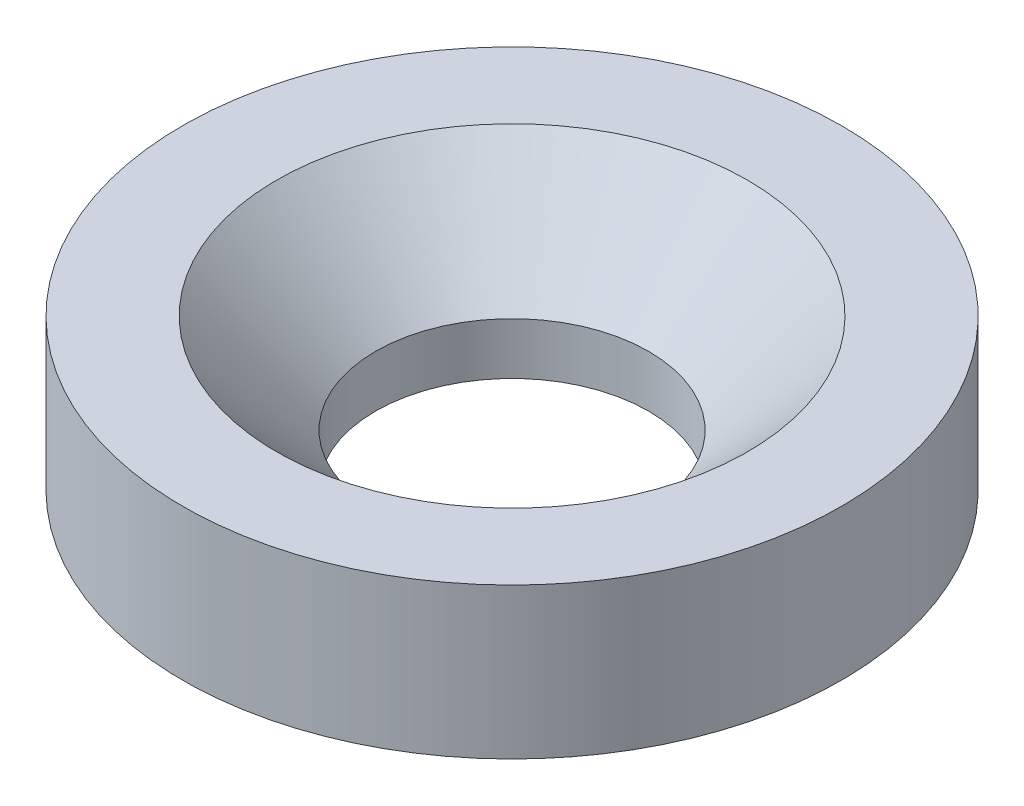
ISO-10303-21;
HEADER;
FILE_DESCRIPTION(('STEP AP214'),'2;1');
FILE_NAME('part.step','',(''),(''),'','','');
FILE_SCHEMA(('AUTOMOTIVE_DESIGN { 1 0 10303 214 1 1 1 1 }'));
ENDSEC;
DATA;
#1=APPLICATION_CONTEXT('core data for automotive mechanical design processes');
#2=APPLICATION_PROTOCOL_DEFINITION('international standard','automotive_design',2000,#1);
#3=PRODUCT_CONTEXT('',#1,'mechanical');
#4=PRODUCT('Part','Part','',(#3));
#5=PRODUCT_RELATED_PRODUCT_CATEGORY('part','',(#4));
#6=PRODUCT_DEFINITION_FORMATION('','',#4);
#7=PRODUCT_DEFINITION_CONTEXT('part definition',#1,'design');
#8=PRODUCT_DEFINITION('design','',#6,#7);
#9=PRODUCT_DEFINITION_SHAPE('','',#8);
#10=(LENGTH_UNIT() NAMED_UNIT(*) SI_UNIT(.MILLI.,.METRE.));
#11=(NAMED_UNIT(*) PLANE_ANGLE_UNIT() SI_UNIT($,.RADIAN.));
#12=(NAMED_UNIT(*) SI_UNIT($,.STERADIAN.) SOLID_ANGLE_UNIT());
#13=UNCERTAINTY_MEASURE_WITH_UNIT(LENGTH_MEASURE(1.E-05),#10,'distance_accuracy_value','');
#14=(GEOMETRIC_REPRESENTATION_CONTEXT(3) GLOBAL_UNCERTAINTY_ASSIGNED_CONTEXT((#13)) GLOBAL_UNIT_ASSIGNED_CONTEXT((#10,
#11,#12)) REPRESENTATION_CONTEXT('',''));
#15=CARTESIAN_POINT('',(0.,0.,0.));
#16=DIRECTION('',(0.,0.,1.));
#17=DIRECTION('',(1.,0.,0.));
#18=AXIS2_PLACEMENT_3D('',#15,#16,#17);
#19=CARTESIAN_POINT('',(0.,0.,0.));
#20=DIRECTION('',(0.,-1.,0.));
#21=DIRECTION('',(0.,0.,-1.));
#22=AXIS2_PLACEMENT_3D('',#19,#20,#21);
#23=CYLINDRICAL_SURFACE('',#22,7.25);
#24=CARTESIAN_POINT('',(0.,0.,0.));
#25=DIRECTION('',(0.,-1.,0.));
#26=DIRECTION('',(0.,0.,-1.));
#27=AXIS2_PLACEMENT_3D('',#24,#25,#26);
#28=CIRCLE('',#27,7.25);
#29=CARTESIAN_POINT('',(0.,0.,-7.25));
#30=VERTEX_POINT('',#29);
#31=EDGE_CURVE('E10',#30,#30,#28,.T.);
#32=ORIENTED_EDGE('',*,*,#31,.T.);
#33=EDGE_LOOP('',(#32));
#34=FACE_BOUND('',#33,.T.);
#35=CARTESIAN_POINT('',(0.,2.74999999999997,0.));
#36=DIRECTION('',(0.,-1.,0.));
#37=DIRECTION('',(0.,0.,-1.));
#38=AXIS2_PLACEMENT_3D('',#35,#36,#37);
#39=CIRCLE('',#38,7.25);
#40=CARTESIAN_POINT('',(0.,2.74999999999997,-7.25));
#41=VERTEX_POINT('',#40);
#42=EDGE_CURVE('E60',#41,#41,#39,.T.);
#43=ORIENTED_EDGE('',*,*,#42,.F.);
#44=EDGE_LOOP('',(#43));
#45=FACE_BOUND('',#44,.T.);
#46=ADVANCED_FACE('F37',(#34,#45),#23,.F.);
#47=CARTESIAN_POINT('',(7.25,0.,0.));
#48=DIRECTION('',(0.,-1.,0.));
#49=DIRECTION('',(0.,0.,-1.));
#50=AXIS2_PLACEMENT_3D('',#47,#48,#49);
#51=PLANE('',#50);
#52=CARTESIAN_POINT('',(0.,0.,0.));
#53=DIRECTION('',(0.,-1.,0.));
#54=DIRECTION('',(0.,0.,-1.));
#55=AXIS2_PLACEMENT_3D('',#52,#53,#54);
#56=CIRCLE('',#55,17.5);
#57=CARTESIAN_POINT('',(0.,0.,-17.5));
#58=VERTEX_POINT('',#57);
#59=EDGE_CURVE('E44',#58,#58,#56,.T.);
#60=ORIENTED_EDGE('',*,*,#59,.T.);
#61=EDGE_LOOP('',(#60));
#62=FACE_BOUND('',#61,.T.);
#63=ORIENTED_EDGE('',*,*,#31,.F.);
#64=EDGE_LOOP('',(#63));
#65=FACE_BOUND('',#64,.T.);
#66=ADVANCED_FACE('F69',(#62,#65),#51,.T.);
#67=CARTESIAN_POINT('',(0.,0.,0.));
#68=DIRECTION('',(0.,-1.,0.));
#69=DIRECTION('',(0.,0.,-1.));
#70=AXIS2_PLACEMENT_3D('',#67,#68,#69);
#71=CYLINDRICAL_SURFACE('',#70,17.5);
#72=CARTESIAN_POINT('',(0.,8.,0.));
#73=DIRECTION('',(0.,-1.,0.));
#74=DIRECTION('',(0.,0.,-1.));
#75=AXIS2_PLACEMENT_3D('',#72,#73,#74);
#76=CIRCLE('',#75,17.5);
#77=CARTESIAN_POINT('',(0.,8.,-17.5));
#78=VERTEX_POINT('',#77);
#79=EDGE_CURVE('E49',#78,#78,#76,.T.);
#80=ORIENTED_EDGE('',*,*,#79,.T.);
#81=EDGE_LOOP('',(#80));
#82=FACE_BOUND('',#81,.T.);
#83=ORIENTED_EDGE('',*,*,#59,.F.);
#84=EDGE_LOOP('',(#83));
#85=FACE_BOUND('',#84,.T.);
#86=ADVANCED_FACE('F73',(#82,#85),#71,.T.);
#87=CARTESIAN_POINT('',(17.5,8.,0.));
#88=DIRECTION('',(0.,1.,0.));
#89=DIRECTION('',(0.,0.,1.));
#90=AXIS2_PLACEMENT_3D('',#87,#88,#89);
#91=PLANE('',#90);
#92=CARTESIAN_POINT('',(0.,8.,0.));
#93=DIRECTION('',(0.,-1.,0.));
#94=DIRECTION('',(0.,0.,-1.));
#95=AXIS2_PLACEMENT_3D('',#92,#93,#94);
#96=CIRCLE('',#95,12.5);
#97=CARTESIAN_POINT('',(0.,8.,-12.5));
#98=VERTEX_POINT('',#97);
#99=EDGE_CURVE('E54',#98,#98,#96,.T.);
#100=ORIENTED_EDGE('',*,*,#99,.T.);
#101=EDGE_LOOP('',(#100));
#102=FACE_BOUND('',#101,.T.);
#103=ORIENTED_EDGE('',*,*,#79,.F.);
#104=EDGE_LOOP('',(#103));
#105=FACE_BOUND('',#104,.T.);
#106=ADVANCED_FACE('F77',(#102,#105),#91,.T.);
#107=CARTESIAN_POINT('',(0.,8.,0.));
#108=DIRECTION('',(0.,1.,0.));
#109=DIRECTION('',(0.,0.,1.));
#110=AXIS2_PLACEMENT_3D('',#107,#108,#109);
#111=CONICAL_SURFACE('',#110,12.5,0.785398163397445);
#112=ORIENTED_EDGE('',*,*,#42,.T.);
#113=EDGE_LOOP('',(#112));
#114=FACE_BOUND('',#113,.T.);
#115=ORIENTED_EDGE('',*,*,#99,.F.);
#116=EDGE_LOOP('',(#115));
#117=FACE_BOUND('',#116,.T.);
#118=ADVANCED_FACE('F65',(#114,#117),#111,.F.);
#119=CLOSED_SHELL('',(#46,#66,#86,#106,#118));
#120=MANIFOLD_SOLID_BREP('B2',#119);
#121=ADVANCED_BREP_SHAPE_REPRESENTATION('',(#18,#120),#14);
#122=SHAPE_DEFINITION_REPRESENTATION(#9,#121);
ENDSEC;
END-ISO-10303-21;
